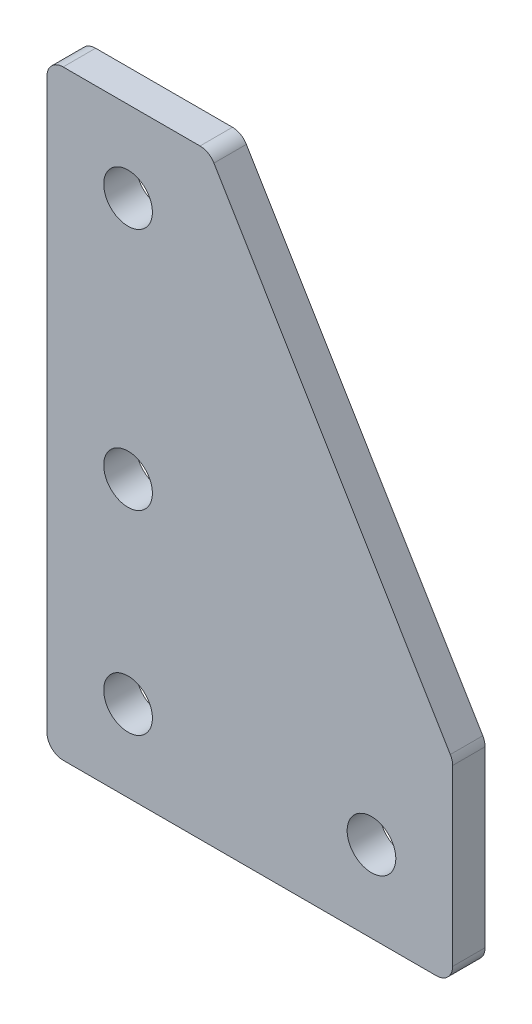
ISO-10303-21;
HEADER;
FILE_DESCRIPTION(('STEP AP214'),'2;1');
FILE_NAME('part.step','',(''),(''),'','','');
FILE_SCHEMA(('AUTOMOTIVE_DESIGN { 1 0 10303 214 1 1 1 1 }'));
ENDSEC;
DATA;
#1=APPLICATION_CONTEXT('core data for automotive mechanical design processes');
#2=APPLICATION_PROTOCOL_DEFINITION('international standard','automotive_design',2000,#1);
#3=PRODUCT_CONTEXT('',#1,'mechanical');
#4=PRODUCT('Part','Part','',(#3));
#5=PRODUCT_RELATED_PRODUCT_CATEGORY('part','',(#4));
#6=PRODUCT_DEFINITION_FORMATION('','',#4);
#7=PRODUCT_DEFINITION_CONTEXT('part definition',#1,'design');
#8=PRODUCT_DEFINITION('design','',#6,#7);
#9=PRODUCT_DEFINITION_SHAPE('','',#8);
#10=(LENGTH_UNIT() NAMED_UNIT(*) SI_UNIT(.MILLI.,.METRE.));
#11=(NAMED_UNIT(*) PLANE_ANGLE_UNIT() SI_UNIT($,.RADIAN.));
#12=(NAMED_UNIT(*) SI_UNIT($,.STERADIAN.) SOLID_ANGLE_UNIT());
#13=UNCERTAINTY_MEASURE_WITH_UNIT(LENGTH_MEASURE(1.E-05),#10,'distance_accuracy_value','');
#14=(GEOMETRIC_REPRESENTATION_CONTEXT(3) GLOBAL_UNCERTAINTY_ASSIGNED_CONTEXT((#13)) GLOBAL_UNIT_ASSIGNED_CONTEXT((#10,
#11,#12)) REPRESENTATION_CONTEXT('',''));
#15=CARTESIAN_POINT('',(0.,0.,0.));
#16=DIRECTION('',(0.,0.,1.));
#17=DIRECTION('',(1.,0.,0.));
#18=AXIS2_PLACEMENT_3D('',#15,#16,#17);
#19=CARTESIAN_POINT('',(0.,0.,2.));
#20=DIRECTION('',(0.,0.,-1.));
#21=DIRECTION('',(-1.,0.,0.));
#22=AXIS2_PLACEMENT_3D('',#19,#20,#21);
#23=PLANE('',#22);
#24=DIRECTION('',(1.,0.,0.));
#25=VECTOR('',#24,1.);
#26=CARTESIAN_POINT('',(20.,-5.,2.));
#27=LINE('',#26,#25);
#28=CARTESIAN_POINT('',(-4.,-5.,2.));
#29=VERTEX_POINT('',#28);
#30=CARTESIAN_POINT('',(19.,-5.,2.));
#31=VERTEX_POINT('',#30);
#32=EDGE_CURVE('E221',#29,#31,#27,.T.);
#33=ORIENTED_EDGE('',*,*,#32,.T.);
#34=CARTESIAN_POINT('',(19.,-4.,2.));
#35=DIRECTION('',(0.,0.,-1.));
#36=DIRECTION('',(-1.,0.,0.));
#37=AXIS2_PLACEMENT_3D('',#34,#35,#36);
#38=CIRCLE('',#37,1.);
#39=CARTESIAN_POINT('',(20.,-4.,2.));
#40=VERTEX_POINT('',#39);
#41=EDGE_CURVE('E174',#31,#40,#38,.F.);
#42=ORIENTED_EDGE('',*,*,#41,.T.);
#43=DIRECTION('',(0.,1.,0.));
#44=VECTOR('',#43,1.);
#45=CARTESIAN_POINT('',(20.,7.,2.));
#46=LINE('',#45,#44);
#47=CARTESIAN_POINT('',(20.,6.72301603505156,2.));
#48=VERTEX_POINT('',#47);
#49=EDGE_CURVE('E137',#40,#48,#46,.T.);
#50=ORIENTED_EDGE('',*,*,#49,.T.);
#51=CARTESIAN_POINT('',(19.,6.72301603505156,2.));
#52=DIRECTION('',(0.,0.,-1.));
#53=DIRECTION('',(-1.,0.,0.));
#54=AXIS2_PLACEMENT_3D('',#51,#52,#53);
#55=CIRCLE('',#54,1.);
#56=CARTESIAN_POINT('',(19.8574929257125,7.23751179047909,2.));
#57=VERTEX_POINT('',#56);
#58=EDGE_CURVE('E170',#48,#57,#55,.F.);
#59=ORIENTED_EDGE('',*,*,#58,.T.);
#60=DIRECTION('',(-0.514495755427526,0.857492925712544,0.));
#61=VECTOR('',#60,1.);
#62=CARTESIAN_POINT('',(5.,32.,2.));
#63=LINE('',#62,#61);
#64=CARTESIAN_POINT('',(5.29130254674348,31.5144957554275,2.));
#65=VERTEX_POINT('',#64);
#66=EDGE_CURVE('E190',#57,#65,#63,.T.);
#67=ORIENTED_EDGE('',*,*,#66,.T.);
#68=CARTESIAN_POINT('',(4.43380962103094,31.,2.));
#69=DIRECTION('',(0.,0.,-1.));
#70=DIRECTION('',(-1.,0.,0.));
#71=AXIS2_PLACEMENT_3D('',#68,#69,#70);
#72=CIRCLE('',#71,1.);
#73=CARTESIAN_POINT('',(4.43380962103094,32.,2.));
#74=VERTEX_POINT('',#73);
#75=EDGE_CURVE('E60',#65,#74,#72,.F.);
#76=ORIENTED_EDGE('',*,*,#75,.T.);
#77=DIRECTION('',(-1.,0.,0.));
#78=VECTOR('',#77,1.);
#79=CARTESIAN_POINT('',(-5.,32.,2.));
#80=LINE('',#79,#78);
#81=CARTESIAN_POINT('',(-4.,32.,2.));
#82=VERTEX_POINT('',#81);
#83=EDGE_CURVE('E157',#74,#82,#80,.T.);
#84=ORIENTED_EDGE('',*,*,#83,.T.);
#85=CARTESIAN_POINT('',(-4.,31.,2.));
#86=DIRECTION('',(0.,0.,-1.));
#87=DIRECTION('',(-1.,0.,0.));
#88=AXIS2_PLACEMENT_3D('',#85,#86,#87);
#89=CIRCLE('',#88,1.);
#90=CARTESIAN_POINT('',(-5.,31.,2.));
#91=VERTEX_POINT('',#90);
#92=EDGE_CURVE('E167',#82,#91,#89,.F.);
#93=ORIENTED_EDGE('',*,*,#92,.T.);
#94=DIRECTION('',(0.,-1.,0.));
#95=VECTOR('',#94,1.);
#96=CARTESIAN_POINT('',(-5.,-5.,2.));
#97=LINE('',#96,#95);
#98=CARTESIAN_POINT('',(-5.,-4.,2.));
#99=VERTEX_POINT('',#98);
#100=EDGE_CURVE('E156',#91,#99,#97,.T.);
#101=ORIENTED_EDGE('',*,*,#100,.T.);
#102=CARTESIAN_POINT('',(-4.,-4.,2.));
#103=DIRECTION('',(0.,0.,-1.));
#104=DIRECTION('',(-1.,0.,0.));
#105=AXIS2_PLACEMENT_3D('',#102,#103,#104);
#106=CIRCLE('',#105,1.);
#107=EDGE_CURVE('E172',#99,#29,#106,.F.);
#108=ORIENTED_EDGE('',*,*,#107,.T.);
#109=EDGE_LOOP('',(#33,#42,#50,#59,#67,#76,#84,#93,#101,#108));
#110=FACE_BOUND('',#109,.T.);
#111=CARTESIAN_POINT('',(0.,12.,2.));
#112=DIRECTION('',(0.,0.,1.));
#113=DIRECTION('',(1.,0.,0.));
#114=AXIS2_PLACEMENT_3D('',#111,#112,#113);
#115=CIRCLE('',#114,1.50000000000002);
#116=CARTESIAN_POINT('',(1.50000000000003,12.,2.));
#117=VERTEX_POINT('',#116);
#118=EDGE_CURVE('E203',#117,#117,#115,.T.);
#119=ORIENTED_EDGE('',*,*,#118,.F.);
#120=EDGE_LOOP('',(#119));
#121=FACE_BOUND('',#120,.T.);
#122=CARTESIAN_POINT('',(0.,27.,2.));
#123=DIRECTION('',(0.,0.,1.));
#124=DIRECTION('',(1.,0.,0.));
#125=AXIS2_PLACEMENT_3D('',#122,#123,#124);
#126=CIRCLE('',#125,1.50000000000003);
#127=CARTESIAN_POINT('',(1.50000000000003,27.,2.));
#128=VERTEX_POINT('',#127);
#129=EDGE_CURVE('E213',#128,#128,#126,.T.);
#130=ORIENTED_EDGE('',*,*,#129,.F.);
#131=EDGE_LOOP('',(#130));
#132=FACE_BOUND('',#131,.T.);
#133=CARTESIAN_POINT('',(15.,0.,2.));
#134=DIRECTION('',(0.,0.,1.));
#135=DIRECTION('',(1.,0.,0.));
#136=AXIS2_PLACEMENT_3D('',#133,#134,#135);
#137=CIRCLE('',#136,1.50000000000003);
#138=CARTESIAN_POINT('',(16.5,0.,2.));
#139=VERTEX_POINT('',#138);
#140=EDGE_CURVE('E284',#139,#139,#137,.T.);
#141=ORIENTED_EDGE('',*,*,#140,.F.);
#142=EDGE_LOOP('',(#141));
#143=FACE_BOUND('',#142,.T.);
#144=CARTESIAN_POINT('',(0.,0.,2.));
#145=DIRECTION('',(0.,0.,1.));
#146=DIRECTION('',(1.,0.,0.));
#147=AXIS2_PLACEMENT_3D('',#144,#145,#146);
#148=CIRCLE('',#147,1.50000000000002);
#149=CARTESIAN_POINT('',(1.50000000000002,0.,2.));
#150=VERTEX_POINT('',#149);
#151=EDGE_CURVE('E290',#150,#150,#148,.T.);
#152=ORIENTED_EDGE('',*,*,#151,.F.);
#153=EDGE_LOOP('',(#152));
#154=FACE_BOUND('',#153,.T.);
#155=ADVANCED_FACE('F39',(#110,#121,#132,#143,#154),#23,.F.);
#156=CARTESIAN_POINT('',(0.,0.,0.));
#157=DIRECTION('',(0.,0.,-1.));
#158=DIRECTION('',(-1.,0.,0.));
#159=AXIS2_PLACEMENT_3D('',#156,#157,#158);
#160=PLANE('',#159);
#161=CARTESIAN_POINT('',(15.,0.,0.));
#162=DIRECTION('',(0.,0.,1.));
#163=DIRECTION('',(1.,0.,0.));
#164=AXIS2_PLACEMENT_3D('',#161,#162,#163);
#165=CIRCLE('',#164,1.50000000000003);
#166=CARTESIAN_POINT('',(16.5,0.,0.));
#167=VERTEX_POINT('',#166);
#168=EDGE_CURVE('E286',#167,#167,#165,.T.);
#169=ORIENTED_EDGE('',*,*,#168,.T.);
#170=EDGE_LOOP('',(#169));
#171=FACE_BOUND('',#170,.T.);
#172=CARTESIAN_POINT('',(0.,12.,0.));
#173=DIRECTION('',(0.,0.,1.));
#174=DIRECTION('',(1.,0.,0.));
#175=AXIS2_PLACEMENT_3D('',#172,#173,#174);
#176=CIRCLE('',#175,1.50000000000002);
#177=CARTESIAN_POINT('',(1.50000000000003,12.,0.));
#178=VERTEX_POINT('',#177);
#179=EDGE_CURVE('E208',#178,#178,#176,.T.);
#180=ORIENTED_EDGE('',*,*,#179,.T.);
#181=EDGE_LOOP('',(#180));
#182=FACE_BOUND('',#181,.T.);
#183=DIRECTION('',(0.,1.,0.));
#184=VECTOR('',#183,1.);
#185=CARTESIAN_POINT('',(20.,7.,0.));
#186=LINE('',#185,#184);
#187=CARTESIAN_POINT('',(20.,-4.,0.));
#188=VERTEX_POINT('',#187);
#189=CARTESIAN_POINT('',(20.,6.72301603505156,0.));
#190=VERTEX_POINT('',#189);
#191=EDGE_CURVE('E134',#188,#190,#186,.T.);
#192=ORIENTED_EDGE('',*,*,#191,.F.);
#193=CARTESIAN_POINT('',(19.,-4.,0.));
#194=DIRECTION('',(0.,0.,-1.));
#195=DIRECTION('',(-1.,0.,0.));
#196=AXIS2_PLACEMENT_3D('',#193,#194,#195);
#197=CIRCLE('',#196,1.);
#198=CARTESIAN_POINT('',(19.,-5.,0.));
#199=VERTEX_POINT('',#198);
#200=EDGE_CURVE('E117',#188,#199,#197,.T.);
#201=ORIENTED_EDGE('',*,*,#200,.T.);
#202=DIRECTION('',(1.,0.,0.));
#203=VECTOR('',#202,1.);
#204=CARTESIAN_POINT('',(20.,-5.,0.));
#205=LINE('',#204,#203);
#206=CARTESIAN_POINT('',(-4.,-5.,0.));
#207=VERTEX_POINT('',#206);
#208=EDGE_CURVE('E146',#207,#199,#205,.T.);
#209=ORIENTED_EDGE('',*,*,#208,.F.);
#210=CARTESIAN_POINT('',(-4.,-4.,0.));
#211=DIRECTION('',(0.,0.,-1.));
#212=DIRECTION('',(-1.,0.,0.));
#213=AXIS2_PLACEMENT_3D('',#210,#211,#212);
#214=CIRCLE('',#213,1.);
#215=CARTESIAN_POINT('',(-5.,-4.,0.));
#216=VERTEX_POINT('',#215);
#217=EDGE_CURVE('E128',#207,#216,#214,.T.);
#218=ORIENTED_EDGE('',*,*,#217,.T.);
#219=DIRECTION('',(0.,-1.,0.));
#220=VECTOR('',#219,1.);
#221=CARTESIAN_POINT('',(-5.,-5.,0.));
#222=LINE('',#221,#220);
#223=CARTESIAN_POINT('',(-5.,31.,0.));
#224=VERTEX_POINT('',#223);
#225=EDGE_CURVE('E151',#224,#216,#222,.T.);
#226=ORIENTED_EDGE('',*,*,#225,.F.);
#227=CARTESIAN_POINT('',(-4.,31.,0.));
#228=DIRECTION('',(0.,0.,-1.));
#229=DIRECTION('',(-1.,0.,0.));
#230=AXIS2_PLACEMENT_3D('',#227,#228,#229);
#231=CIRCLE('',#230,1.);
#232=CARTESIAN_POINT('',(-4.,32.,0.));
#233=VERTEX_POINT('',#232);
#234=EDGE_CURVE('E138',#224,#233,#231,.T.);
#235=ORIENTED_EDGE('',*,*,#234,.T.);
#236=DIRECTION('',(-1.,0.,0.));
#237=VECTOR('',#236,1.);
#238=CARTESIAN_POINT('',(-5.,32.,0.));
#239=LINE('',#238,#237);
#240=CARTESIAN_POINT('',(4.43380962103094,32.,0.));
#241=VERTEX_POINT('',#240);
#242=EDGE_CURVE('E149',#241,#233,#239,.T.);
#243=ORIENTED_EDGE('',*,*,#242,.F.);
#244=CARTESIAN_POINT('',(4.43380962103094,31.,0.));
#245=DIRECTION('',(0.,0.,-1.));
#246=DIRECTION('',(-1.,0.,0.));
#247=AXIS2_PLACEMENT_3D('',#244,#245,#246);
#248=CIRCLE('',#247,1.);
#249=CARTESIAN_POINT('',(5.29130254674348,31.5144957554275,0.));
#250=VERTEX_POINT('',#249);
#251=EDGE_CURVE('E160',#241,#250,#248,.T.);
#252=ORIENTED_EDGE('',*,*,#251,.T.);
#253=DIRECTION('',(-0.514495755427526,0.857492925712544,0.));
#254=VECTOR('',#253,1.);
#255=CARTESIAN_POINT('',(5.,32.,0.));
#256=LINE('',#255,#254);
#257=CARTESIAN_POINT('',(19.8574929257125,7.23751179047909,0.));
#258=VERTEX_POINT('',#257);
#259=EDGE_CURVE('E145',#258,#250,#256,.T.);
#260=ORIENTED_EDGE('',*,*,#259,.F.);
#261=CARTESIAN_POINT('',(19.,6.72301603505156,0.));
#262=DIRECTION('',(0.,0.,-1.));
#263=DIRECTION('',(-1.,0.,0.));
#264=AXIS2_PLACEMENT_3D('',#261,#262,#263);
#265=CIRCLE('',#264,1.);
#266=EDGE_CURVE('E144',#258,#190,#265,.T.);
#267=ORIENTED_EDGE('',*,*,#266,.T.);
#268=EDGE_LOOP('',(#192,#201,#209,#218,#226,#235,#243,#252,#260,#267));
#269=FACE_BOUND('',#268,.T.);
#270=CARTESIAN_POINT('',(0.,27.,0.));
#271=DIRECTION('',(0.,0.,1.));
#272=DIRECTION('',(1.,0.,0.));
#273=AXIS2_PLACEMENT_3D('',#270,#271,#272);
#274=CIRCLE('',#273,1.50000000000003);
#275=CARTESIAN_POINT('',(1.50000000000003,27.,0.));
#276=VERTEX_POINT('',#275);
#277=EDGE_CURVE('E216',#276,#276,#274,.T.);
#278=ORIENTED_EDGE('',*,*,#277,.T.);
#279=EDGE_LOOP('',(#278));
#280=FACE_BOUND('',#279,.T.);
#281=CARTESIAN_POINT('',(0.,0.,0.));
#282=DIRECTION('',(0.,0.,1.));
#283=DIRECTION('',(1.,0.,0.));
#284=AXIS2_PLACEMENT_3D('',#281,#282,#283);
#285=CIRCLE('',#284,1.50000000000002);
#286=CARTESIAN_POINT('',(1.50000000000002,0.,0.));
#287=VERTEX_POINT('',#286);
#288=EDGE_CURVE('E293',#287,#287,#285,.T.);
#289=ORIENTED_EDGE('',*,*,#288,.T.);
#290=EDGE_LOOP('',(#289));
#291=FACE_BOUND('',#290,.T.);
#292=ADVANCED_FACE('F141',(#171,#182,#269,#280,#291),#160,.T.);
#293=CARTESIAN_POINT('',(-5.,-5.,2.));
#294=DIRECTION('',(1.,0.,0.));
#295=DIRECTION('',(0.,0.,-1.));
#296=AXIS2_PLACEMENT_3D('',#293,#294,#295);
#297=PLANE('',#296);
#298=ORIENTED_EDGE('',*,*,#225,.T.);
#299=DIRECTION('',(0.,0.,-1.));
#300=VECTOR('',#299,1.);
#301=CARTESIAN_POINT('',(-5.,-4.,2.));
#302=LINE('',#301,#300);
#303=EDGE_CURVE('E179',#216,#99,#302,.F.);
#304=ORIENTED_EDGE('',*,*,#303,.T.);
#305=ORIENTED_EDGE('',*,*,#100,.F.);
#306=DIRECTION('',(0.,0.,-1.));
#307=VECTOR('',#306,1.);
#308=CARTESIAN_POINT('',(-5.,31.,2.));
#309=LINE('',#308,#307);
#310=EDGE_CURVE('E176',#91,#224,#309,.T.);
#311=ORIENTED_EDGE('',*,*,#310,.T.);
#312=EDGE_LOOP('',(#298,#304,#305,#311));
#313=FACE_BOUND('',#312,.T.);
#314=ADVANCED_FACE('F239',(#313),#297,.F.);
#315=CARTESIAN_POINT('',(20.,-5.,2.));
#316=DIRECTION('',(0.,1.,0.));
#317=DIRECTION('',(-1.,0.,0.));
#318=AXIS2_PLACEMENT_3D('',#315,#316,#317);
#319=PLANE('',#318);
#320=ORIENTED_EDGE('',*,*,#208,.T.);
#321=DIRECTION('',(0.,0.,-1.));
#322=VECTOR('',#321,1.);
#323=CARTESIAN_POINT('',(19.,-5.,2.));
#324=LINE('',#323,#322);
#325=EDGE_CURVE('E122',#199,#31,#324,.F.);
#326=ORIENTED_EDGE('',*,*,#325,.T.);
#327=ORIENTED_EDGE('',*,*,#32,.F.);
#328=DIRECTION('',(0.,0.,-1.));
#329=VECTOR('',#328,1.);
#330=CARTESIAN_POINT('',(-4.,-5.,2.));
#331=LINE('',#330,#329);
#332=EDGE_CURVE('E127',#29,#207,#331,.T.);
#333=ORIENTED_EDGE('',*,*,#332,.T.);
#334=EDGE_LOOP('',(#320,#326,#327,#333));
#335=FACE_BOUND('',#334,.T.);
#336=ADVANCED_FACE('F252',(#335),#319,.F.);
#337=CARTESIAN_POINT('',(20.,7.,2.));
#338=DIRECTION('',(-1.,0.,0.));
#339=DIRECTION('',(0.,-1.,0.));
#340=AXIS2_PLACEMENT_3D('',#337,#338,#339);
#341=PLANE('',#340);
#342=ORIENTED_EDGE('',*,*,#49,.F.);
#343=DIRECTION('',(0.,0.,-1.));
#344=VECTOR('',#343,1.);
#345=CARTESIAN_POINT('',(20.,-4.,2.));
#346=LINE('',#345,#344);
#347=EDGE_CURVE('E121',#40,#188,#346,.T.);
#348=ORIENTED_EDGE('',*,*,#347,.T.);
#349=ORIENTED_EDGE('',*,*,#191,.T.);
#350=DIRECTION('',(0.,0.,-1.));
#351=VECTOR('',#350,1.);
#352=CARTESIAN_POINT('',(20.,6.72301603505156,2.));
#353=LINE('',#352,#351);
#354=EDGE_CURVE('E139',#190,#48,#353,.F.);
#355=ORIENTED_EDGE('',*,*,#354,.T.);
#356=EDGE_LOOP('',(#342,#348,#349,#355));
#357=FACE_BOUND('',#356,.T.);
#358=ADVANCED_FACE('F133',(#357),#341,.F.);
#359=CARTESIAN_POINT('',(5.,32.,2.));
#360=DIRECTION('',(-0.857492925712544,-0.514495755427526,0.));
#361=DIRECTION('',(0.514495755427526,-0.857492925712544,0.));
#362=AXIS2_PLACEMENT_3D('',#359,#360,#361);
#363=PLANE('',#362);
#364=ORIENTED_EDGE('',*,*,#66,.F.);
#365=DIRECTION('',(0.,0.,-1.));
#366=VECTOR('',#365,1.);
#367=CARTESIAN_POINT('',(19.8574929257125,7.23751179047909,2.));
#368=LINE('',#367,#366);
#369=EDGE_CURVE('E183',#57,#258,#368,.T.);
#370=ORIENTED_EDGE('',*,*,#369,.T.);
#371=ORIENTED_EDGE('',*,*,#259,.T.);
#372=DIRECTION('',(0.,0.,-1.));
#373=VECTOR('',#372,1.);
#374=CARTESIAN_POINT('',(5.29130254674348,31.5144957554275,2.));
#375=LINE('',#374,#373);
#376=EDGE_CURVE('E181',#250,#65,#375,.F.);
#377=ORIENTED_EDGE('',*,*,#376,.T.);
#378=EDGE_LOOP('',(#364,#370,#371,#377));
#379=FACE_BOUND('',#378,.T.);
#380=ADVANCED_FACE('F188',(#379),#363,.F.);
#381=CARTESIAN_POINT('',(-5.,32.,2.));
#382=DIRECTION('',(0.,-1.,0.));
#383=DIRECTION('',(0.,0.,-1.));
#384=AXIS2_PLACEMENT_3D('',#381,#382,#383);
#385=PLANE('',#384);
#386=ORIENTED_EDGE('',*,*,#83,.F.);
#387=DIRECTION('',(0.,0.,-1.));
#388=VECTOR('',#387,1.);
#389=CARTESIAN_POINT('',(4.43380962103094,32.,2.));
#390=LINE('',#389,#388);
#391=EDGE_CURVE('E11',#74,#241,#390,.T.);
#392=ORIENTED_EDGE('',*,*,#391,.T.);
#393=ORIENTED_EDGE('',*,*,#242,.T.);
#394=DIRECTION('',(0.,0.,-1.));
#395=VECTOR('',#394,1.);
#396=CARTESIAN_POINT('',(-4.,32.,2.));
#397=LINE('',#396,#395);
#398=EDGE_CURVE('E47',#233,#82,#397,.F.);
#399=ORIENTED_EDGE('',*,*,#398,.T.);
#400=EDGE_LOOP('',(#386,#392,#393,#399));
#401=FACE_BOUND('',#400,.T.);
#402=ADVANCED_FACE('F197',(#401),#385,.F.);
#403=CARTESIAN_POINT('',(0.,12.,2.));
#404=DIRECTION('',(0.,0.,-1.));
#405=DIRECTION('',(-1.,0.,0.));
#406=AXIS2_PLACEMENT_3D('',#403,#404,#405);
#407=CYLINDRICAL_SURFACE('',#406,1.50000000000002);
#408=ORIENTED_EDGE('',*,*,#118,.T.);
#409=EDGE_LOOP('',(#408));
#410=FACE_BOUND('',#409,.T.);
#411=ORIENTED_EDGE('',*,*,#179,.F.);
#412=EDGE_LOOP('',(#411));
#413=FACE_BOUND('',#412,.T.);
#414=ADVANCED_FACE('F243',(#410,#413),#407,.F.);
#415=CARTESIAN_POINT('',(0.,27.,2.));
#416=DIRECTION('',(0.,0.,-1.));
#417=DIRECTION('',(-1.,0.,0.));
#418=AXIS2_PLACEMENT_3D('',#415,#416,#417);
#419=CYLINDRICAL_SURFACE('',#418,1.50000000000003);
#420=ORIENTED_EDGE('',*,*,#129,.T.);
#421=EDGE_LOOP('',(#420));
#422=FACE_BOUND('',#421,.T.);
#423=ORIENTED_EDGE('',*,*,#277,.F.);
#424=EDGE_LOOP('',(#423));
#425=FACE_BOUND('',#424,.T.);
#426=ADVANCED_FACE('F269',(#422,#425),#419,.F.);
#427=CARTESIAN_POINT('',(15.,0.,2.));
#428=DIRECTION('',(0.,0.,-1.));
#429=DIRECTION('',(-1.,0.,0.));
#430=AXIS2_PLACEMENT_3D('',#427,#428,#429);
#431=CYLINDRICAL_SURFACE('',#430,1.50000000000003);
#432=ORIENTED_EDGE('',*,*,#140,.T.);
#433=EDGE_LOOP('',(#432));
#434=FACE_BOUND('',#433,.T.);
#435=ORIENTED_EDGE('',*,*,#168,.F.);
#436=EDGE_LOOP('',(#435));
#437=FACE_BOUND('',#436,.T.);
#438=ADVANCED_FACE('F263',(#434,#437),#431,.F.);
#439=CARTESIAN_POINT('',(0.,0.,2.));
#440=DIRECTION('',(0.,0.,-1.));
#441=DIRECTION('',(-1.,0.,0.));
#442=AXIS2_PLACEMENT_3D('',#439,#440,#441);
#443=CYLINDRICAL_SURFACE('',#442,1.50000000000002);
#444=ORIENTED_EDGE('',*,*,#151,.T.);
#445=EDGE_LOOP('',(#444));
#446=FACE_BOUND('',#445,.T.);
#447=ORIENTED_EDGE('',*,*,#288,.F.);
#448=EDGE_LOOP('',(#447));
#449=FACE_BOUND('',#448,.T.);
#450=ADVANCED_FACE('F259',(#446,#449),#443,.F.);
#451=CARTESIAN_POINT('',(19.,-4.,2.));
#452=DIRECTION('',(0.,0.,-1.));
#453=DIRECTION('',(-1.,0.,0.));
#454=AXIS2_PLACEMENT_3D('',#451,#452,#453);
#455=CYLINDRICAL_SURFACE('',#454,1.);
#456=ORIENTED_EDGE('',*,*,#41,.F.);
#457=ORIENTED_EDGE('',*,*,#325,.F.);
#458=ORIENTED_EDGE('',*,*,#200,.F.);
#459=ORIENTED_EDGE('',*,*,#347,.F.);
#460=EDGE_LOOP('',(#456,#457,#458,#459));
#461=FACE_BOUND('',#460,.T.);
#462=ADVANCED_FACE('F120',(#461),#455,.T.);
#463=CARTESIAN_POINT('',(-4.,-4.,2.));
#464=DIRECTION('',(0.,0.,-1.));
#465=DIRECTION('',(-1.,0.,0.));
#466=AXIS2_PLACEMENT_3D('',#463,#464,#465);
#467=CYLINDRICAL_SURFACE('',#466,1.);
#468=ORIENTED_EDGE('',*,*,#107,.F.);
#469=ORIENTED_EDGE('',*,*,#303,.F.);
#470=ORIENTED_EDGE('',*,*,#217,.F.);
#471=ORIENTED_EDGE('',*,*,#332,.F.);
#472=EDGE_LOOP('',(#468,#469,#470,#471));
#473=FACE_BOUND('',#472,.T.);
#474=ADVANCED_FACE('F226',(#473),#467,.T.);
#475=CARTESIAN_POINT('',(19.,6.72301603505156,2.));
#476=DIRECTION('',(0.,0.,-1.));
#477=DIRECTION('',(-1.,0.,0.));
#478=AXIS2_PLACEMENT_3D('',#475,#476,#477);
#479=CYLINDRICAL_SURFACE('',#478,1.);
#480=ORIENTED_EDGE('',*,*,#58,.F.);
#481=ORIENTED_EDGE('',*,*,#354,.F.);
#482=ORIENTED_EDGE('',*,*,#266,.F.);
#483=ORIENTED_EDGE('',*,*,#369,.F.);
#484=EDGE_LOOP('',(#480,#481,#482,#483));
#485=FACE_BOUND('',#484,.T.);
#486=ADVANCED_FACE('F224',(#485),#479,.T.);
#487=CARTESIAN_POINT('',(4.43380962103094,31.,2.));
#488=DIRECTION('',(0.,0.,-1.));
#489=DIRECTION('',(-1.,0.,0.));
#490=AXIS2_PLACEMENT_3D('',#487,#488,#489);
#491=CYLINDRICAL_SURFACE('',#490,1.);
#492=ORIENTED_EDGE('',*,*,#75,.F.);
#493=ORIENTED_EDGE('',*,*,#376,.F.);
#494=ORIENTED_EDGE('',*,*,#251,.F.);
#495=ORIENTED_EDGE('',*,*,#391,.F.);
#496=EDGE_LOOP('',(#492,#493,#494,#495));
#497=FACE_BOUND('',#496,.T.);
#498=ADVANCED_FACE('F196',(#497),#491,.T.);
#499=CARTESIAN_POINT('',(-4.,31.,2.));
#500=DIRECTION('',(0.,0.,-1.));
#501=DIRECTION('',(-1.,0.,0.));
#502=AXIS2_PLACEMENT_3D('',#499,#500,#501);
#503=CYLINDRICAL_SURFACE('',#502,1.);
#504=ORIENTED_EDGE('',*,*,#92,.F.);
#505=ORIENTED_EDGE('',*,*,#398,.F.);
#506=ORIENTED_EDGE('',*,*,#234,.F.);
#507=ORIENTED_EDGE('',*,*,#310,.F.);
#508=EDGE_LOOP('',(#504,#505,#506,#507));
#509=FACE_BOUND('',#508,.T.);
#510=ADVANCED_FACE('F41',(#509),#503,.T.);
#511=CLOSED_SHELL('',(#155,#292,#314,#336,#358,#380,#402,#414,#426,#438,#450,#462,#474,#486,
#498,#510));
#512=MANIFOLD_SOLID_BREP('B2',#511);
#513=ADVANCED_BREP_SHAPE_REPRESENTATION('',(#18,#512),#14);
#514=SHAPE_DEFINITION_REPRESENTATION(#9,#513);
ENDSEC;
END-ISO-10303-21;
